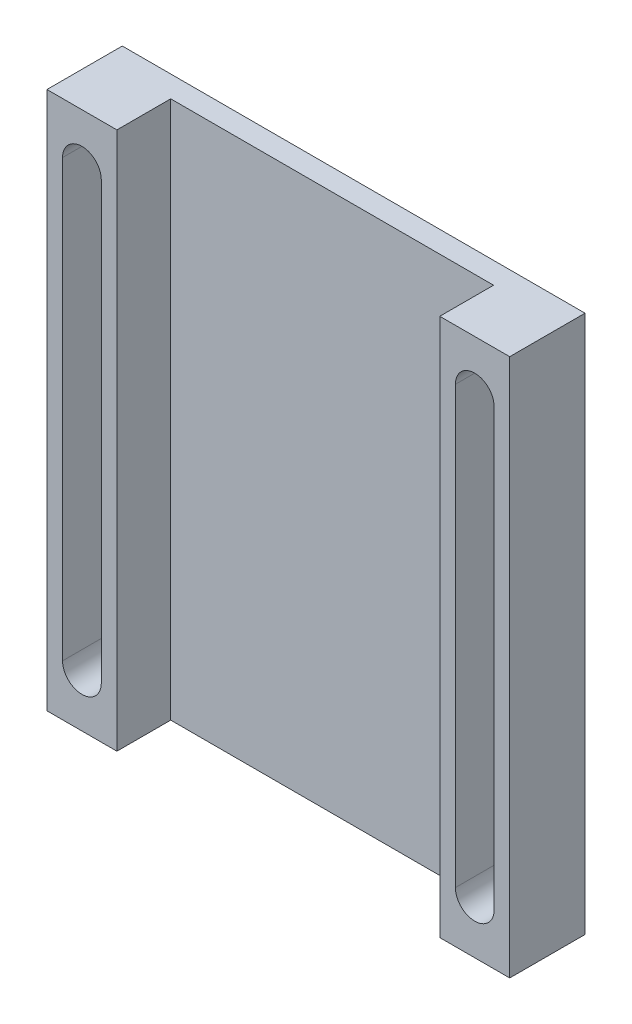
ISO-10303-21;
HEADER;
FILE_DESCRIPTION(('STEP AP214'),'2;1');
FILE_NAME('part.step','',(''),(''),'','','');
FILE_SCHEMA(('AUTOMOTIVE_DESIGN { 1 0 10303 214 1 1 1 1 }'));
ENDSEC;
DATA;
#1=APPLICATION_CONTEXT('core data for automotive mechanical design processes');
#2=APPLICATION_PROTOCOL_DEFINITION('international standard','automotive_design',2000,#1);
#3=PRODUCT_CONTEXT('',#1,'mechanical');
#4=PRODUCT('Part','Part','',(#3));
#5=PRODUCT_RELATED_PRODUCT_CATEGORY('part','',(#4));
#6=PRODUCT_DEFINITION_FORMATION('','',#4);
#7=PRODUCT_DEFINITION_CONTEXT('part definition',#1,'design');
#8=PRODUCT_DEFINITION('design','',#6,#7);
#9=PRODUCT_DEFINITION_SHAPE('','',#8);
#10=(LENGTH_UNIT() NAMED_UNIT(*) SI_UNIT(.MILLI.,.METRE.));
#11=(NAMED_UNIT(*) PLANE_ANGLE_UNIT() SI_UNIT($,.RADIAN.));
#12=(NAMED_UNIT(*) SI_UNIT($,.STERADIAN.) SOLID_ANGLE_UNIT());
#13=UNCERTAINTY_MEASURE_WITH_UNIT(LENGTH_MEASURE(1.E-05),#10,'distance_accuracy_value','');
#14=(GEOMETRIC_REPRESENTATION_CONTEXT(3) GLOBAL_UNCERTAINTY_ASSIGNED_CONTEXT((#13)) GLOBAL_UNIT_ASSIGNED_CONTEXT((#10,
#11,#12)) REPRESENTATION_CONTEXT('',''));
#15=CARTESIAN_POINT('',(0.,0.,0.));
#16=DIRECTION('',(0.,0.,1.));
#17=DIRECTION('',(1.,0.,0.));
#18=AXIS2_PLACEMENT_3D('',#15,#16,#17);
#19=CARTESIAN_POINT('',(0.,0.,70.));
#20=DIRECTION('',(0.,0.,1.));
#21=DIRECTION('',(1.,0.,0.));
#22=AXIS2_PLACEMENT_3D('',#19,#20,#21);
#23=PLANE('',#22);
#24=DIRECTION('',(1.,0.,0.));
#25=VECTOR('',#24,1.);
#26=CARTESIAN_POINT('',(0.,250.,70.));
#27=LINE('',#26,#25);
#28=CARTESIAN_POINT('',(150.,250.,70.));
#29=VERTEX_POINT('',#28);
#30=CARTESIAN_POINT('',(215.,250.,70.));
#31=VERTEX_POINT('',#30);
#32=EDGE_CURVE('E268',#29,#31,#27,.T.);
#33=ORIENTED_EDGE('',*,*,#32,.F.);
#34=DIRECTION('',(0.,-1.,0.));
#35=VECTOR('',#34,1.);
#36=CARTESIAN_POINT('',(150.,0.,70.));
#37=LINE('',#36,#35);
#38=CARTESIAN_POINT('',(150.,-250.,70.));
#39=VERTEX_POINT('',#38);
#40=EDGE_CURVE('E271',#29,#39,#37,.T.);
#41=ORIENTED_EDGE('',*,*,#40,.T.);
#42=DIRECTION('',(1.,0.,0.));
#43=VECTOR('',#42,1.);
#44=CARTESIAN_POINT('',(0.,-250.,70.));
#45=LINE('',#44,#43);
#46=CARTESIAN_POINT('',(215.,-250.,70.));
#47=VERTEX_POINT('',#46);
#48=EDGE_CURVE('E273',#39,#47,#45,.T.);
#49=ORIENTED_EDGE('',*,*,#48,.T.);
#50=DIRECTION('',(0.,-1.,0.));
#51=VECTOR('',#50,1.);
#52=CARTESIAN_POINT('',(215.,0.,70.));
#53=LINE('',#52,#51);
#54=EDGE_CURVE('E275',#31,#47,#53,.T.);
#55=ORIENTED_EDGE('',*,*,#54,.F.);
#56=EDGE_LOOP('',(#33,#41,#49,#55));
#57=FACE_BOUND('',#56,.T.);
#58=CARTESIAN_POINT('',(182.5,-202.5,70.));
#59=DIRECTION('',(0.,0.,1.));
#60=DIRECTION('',(1.,0.,0.));
#61=AXIS2_PLACEMENT_3D('',#58,#59,#60);
#62=CIRCLE('',#61,18.);
#63=CARTESIAN_POINT('',(164.5,-202.5,70.));
#64=VERTEX_POINT('',#63);
#65=CARTESIAN_POINT('',(200.5,-202.5,70.));
#66=VERTEX_POINT('',#65);
#67=EDGE_CURVE('E223',#64,#66,#62,.T.);
#68=ORIENTED_EDGE('',*,*,#67,.F.);
#69=DIRECTION('',(0.,1.,0.));
#70=VECTOR('',#69,1.);
#71=CARTESIAN_POINT('',(164.5,0.,70.));
#72=LINE('',#71,#70);
#73=CARTESIAN_POINT('',(164.5,202.5,70.));
#74=VERTEX_POINT('',#73);
#75=EDGE_CURVE('E78',#64,#74,#72,.T.);
#76=ORIENTED_EDGE('',*,*,#75,.T.);
#77=CARTESIAN_POINT('',(182.5,202.5,70.));
#78=DIRECTION('',(0.,0.,1.));
#79=DIRECTION('',(1.,0.,0.));
#80=AXIS2_PLACEMENT_3D('',#77,#78,#79);
#81=CIRCLE('',#80,18.);
#82=CARTESIAN_POINT('',(200.5,202.5,70.));
#83=VERTEX_POINT('',#82);
#84=EDGE_CURVE('E230',#83,#74,#81,.T.);
#85=ORIENTED_EDGE('',*,*,#84,.F.);
#86=DIRECTION('',(0.,1.,0.));
#87=VECTOR('',#86,1.);
#88=CARTESIAN_POINT('',(200.5,0.,70.));
#89=LINE('',#88,#87);
#90=EDGE_CURVE('E226',#66,#83,#89,.T.);
#91=ORIENTED_EDGE('',*,*,#90,.F.);
#92=EDGE_LOOP('',(#68,#76,#85,#91));
#93=FACE_BOUND('',#92,.T.);
#94=ADVANCED_FACE('F61',(#57,#93),#23,.T.);
#95=CARTESIAN_POINT('',(0.,250.,20.));
#96=DIRECTION('',(0.,1.,0.));
#97=DIRECTION('',(0.,0.,1.));
#98=AXIS2_PLACEMENT_3D('',#95,#96,#97);
#99=PLANE('',#98);
#100=DIRECTION('',(1.,0.,0.));
#101=VECTOR('',#100,1.);
#102=CARTESIAN_POINT('',(0.,250.,0.));
#103=LINE('',#102,#101);
#104=CARTESIAN_POINT('',(-215.,250.,0.));
#105=VERTEX_POINT('',#104);
#106=CARTESIAN_POINT('',(215.,250.,0.));
#107=VERTEX_POINT('',#106);
#108=EDGE_CURVE('E292',#105,#107,#103,.T.);
#109=ORIENTED_EDGE('',*,*,#108,.F.);
#110=DIRECTION('',(0.,0.,-1.));
#111=VECTOR('',#110,1.);
#112=CARTESIAN_POINT('',(-215.,250.,70.));
#113=LINE('',#112,#111);
#114=CARTESIAN_POINT('',(-215.,250.,70.));
#115=VERTEX_POINT('',#114);
#116=EDGE_CURVE('E210',#115,#105,#113,.T.);
#117=ORIENTED_EDGE('',*,*,#116,.F.);
#118=DIRECTION('',(1.,0.,0.));
#119=VECTOR('',#118,1.);
#120=CARTESIAN_POINT('',(0.,250.,70.));
#121=LINE('',#120,#119);
#122=CARTESIAN_POINT('',(-150.,250.,70.));
#123=VERTEX_POINT('',#122);
#124=EDGE_CURVE('E258',#115,#123,#121,.T.);
#125=ORIENTED_EDGE('',*,*,#124,.T.);
#126=DIRECTION('',(0.,0.,-1.));
#127=VECTOR('',#126,1.);
#128=CARTESIAN_POINT('',(-150.,250.,70.));
#129=LINE('',#128,#127);
#130=CARTESIAN_POINT('',(-150.,250.,20.));
#131=VERTEX_POINT('',#130);
#132=EDGE_CURVE('E250',#123,#131,#129,.T.);
#133=ORIENTED_EDGE('',*,*,#132,.T.);
#134=DIRECTION('',(1.,0.,0.));
#135=VECTOR('',#134,1.);
#136=CARTESIAN_POINT('',(0.,250.,20.));
#137=LINE('',#136,#135);
#138=CARTESIAN_POINT('',(150.,250.,20.));
#139=VERTEX_POINT('',#138);
#140=EDGE_CURVE('E293',#131,#139,#137,.T.);
#141=ORIENTED_EDGE('',*,*,#140,.T.);
#142=DIRECTION('',(0.,0.,-1.));
#143=VECTOR('',#142,1.);
#144=CARTESIAN_POINT('',(150.,250.,70.));
#145=LINE('',#144,#143);
#146=EDGE_CURVE('E289',#29,#139,#145,.T.);
#147=ORIENTED_EDGE('',*,*,#146,.F.);
#148=ORIENTED_EDGE('',*,*,#32,.T.);
#149=DIRECTION('',(0.,0.,-1.));
#150=VECTOR('',#149,1.);
#151=CARTESIAN_POINT('',(215.,250.,70.));
#152=LINE('',#151,#150);
#153=EDGE_CURVE('E278',#31,#107,#152,.T.);
#154=ORIENTED_EDGE('',*,*,#153,.T.);
#155=EDGE_LOOP('',(#109,#117,#125,#133,#141,#147,#148,#154));
#156=FACE_BOUND('',#155,.T.);
#157=ADVANCED_FACE('F63',(#156),#99,.T.);
#158=CARTESIAN_POINT('',(0.,-250.,20.));
#159=DIRECTION('',(0.,1.,0.));
#160=DIRECTION('',(0.,0.,1.));
#161=AXIS2_PLACEMENT_3D('',#158,#159,#160);
#162=PLANE('',#161);
#163=DIRECTION('',(1.,0.,0.));
#164=VECTOR('',#163,1.);
#165=CARTESIAN_POINT('',(0.,-250.,0.));
#166=LINE('',#165,#164);
#167=CARTESIAN_POINT('',(-215.,-250.,0.));
#168=VERTEX_POINT('',#167);
#169=CARTESIAN_POINT('',(215.,-250.,0.));
#170=VERTEX_POINT('',#169);
#171=EDGE_CURVE('E65',#168,#170,#166,.T.);
#172=ORIENTED_EDGE('',*,*,#171,.T.);
#173=DIRECTION('',(0.,0.,-1.));
#174=VECTOR('',#173,1.);
#175=CARTESIAN_POINT('',(215.,-250.,70.));
#176=LINE('',#175,#174);
#177=EDGE_CURVE('E283',#47,#170,#176,.T.);
#178=ORIENTED_EDGE('',*,*,#177,.F.);
#179=ORIENTED_EDGE('',*,*,#48,.F.);
#180=DIRECTION('',(0.,0.,-1.));
#181=VECTOR('',#180,1.);
#182=CARTESIAN_POINT('',(150.,-250.,70.));
#183=LINE('',#182,#181);
#184=CARTESIAN_POINT('',(150.,-250.,20.));
#185=VERTEX_POINT('',#184);
#186=EDGE_CURVE('E286',#39,#185,#183,.T.);
#187=ORIENTED_EDGE('',*,*,#186,.T.);
#188=DIRECTION('',(1.,0.,0.));
#189=VECTOR('',#188,1.);
#190=CARTESIAN_POINT('',(0.,-250.,20.));
#191=LINE('',#190,#189);
#192=CARTESIAN_POINT('',(-150.,-250.,20.));
#193=VERTEX_POINT('',#192);
#194=EDGE_CURVE('E70',#193,#185,#191,.T.);
#195=ORIENTED_EDGE('',*,*,#194,.F.);
#196=DIRECTION('',(0.,0.,-1.));
#197=VECTOR('',#196,1.);
#198=CARTESIAN_POINT('',(-150.,-250.,70.));
#199=LINE('',#198,#197);
#200=CARTESIAN_POINT('',(-150.,-250.,70.));
#201=VERTEX_POINT('',#200);
#202=EDGE_CURVE('E248',#201,#193,#199,.T.);
#203=ORIENTED_EDGE('',*,*,#202,.F.);
#204=DIRECTION('',(1.,0.,0.));
#205=VECTOR('',#204,1.);
#206=CARTESIAN_POINT('',(0.,-250.,70.));
#207=LINE('',#206,#205);
#208=CARTESIAN_POINT('',(-215.,-250.,70.));
#209=VERTEX_POINT('',#208);
#210=EDGE_CURVE('E261',#209,#201,#207,.T.);
#211=ORIENTED_EDGE('',*,*,#210,.F.);
#212=DIRECTION('',(0.,0.,-1.));
#213=VECTOR('',#212,1.);
#214=CARTESIAN_POINT('',(-215.,-250.,70.));
#215=LINE('',#214,#213);
#216=EDGE_CURVE('E245',#209,#168,#215,.T.);
#217=ORIENTED_EDGE('',*,*,#216,.T.);
#218=EDGE_LOOP('',(#172,#178,#179,#187,#195,#203,#211,#217));
#219=FACE_BOUND('',#218,.T.);
#220=ADVANCED_FACE('F302',(#219),#162,.F.);
#221=CARTESIAN_POINT('',(0.,0.,20.));
#222=DIRECTION('',(0.,0.,1.));
#223=DIRECTION('',(1.,0.,0.));
#224=AXIS2_PLACEMENT_3D('',#221,#222,#223);
#225=PLANE('',#224);
#226=ORIENTED_EDGE('',*,*,#140,.F.);
#227=DIRECTION('',(0.,-1.,0.));
#228=VECTOR('',#227,1.);
#229=CARTESIAN_POINT('',(-150.,0.,20.));
#230=LINE('',#229,#228);
#231=EDGE_CURVE('E295',#131,#193,#230,.T.);
#232=ORIENTED_EDGE('',*,*,#231,.T.);
#233=ORIENTED_EDGE('',*,*,#194,.T.);
#234=DIRECTION('',(0.,-1.,0.));
#235=VECTOR('',#234,1.);
#236=CARTESIAN_POINT('',(150.,0.,20.));
#237=LINE('',#236,#235);
#238=EDGE_CURVE('E12',#139,#185,#237,.T.);
#239=ORIENTED_EDGE('',*,*,#238,.F.);
#240=EDGE_LOOP('',(#226,#232,#233,#239));
#241=FACE_BOUND('',#240,.T.);
#242=ADVANCED_FACE('F312',(#241),#225,.T.);
#243=CARTESIAN_POINT('',(0.,0.,0.));
#244=DIRECTION('',(0.,0.,1.));
#245=DIRECTION('',(1.,0.,0.));
#246=AXIS2_PLACEMENT_3D('',#243,#244,#245);
#247=PLANE('',#246);
#248=ORIENTED_EDGE('',*,*,#108,.T.);
#249=DIRECTION('',(0.,-1.,0.));
#250=VECTOR('',#249,1.);
#251=CARTESIAN_POINT('',(215.,0.,0.));
#252=LINE('',#251,#250);
#253=EDGE_CURVE('E257',#107,#170,#252,.T.);
#254=ORIENTED_EDGE('',*,*,#253,.T.);
#255=ORIENTED_EDGE('',*,*,#171,.F.);
#256=DIRECTION('',(0.,-1.,0.));
#257=VECTOR('',#256,1.);
#258=CARTESIAN_POINT('',(-215.,0.,0.));
#259=LINE('',#258,#257);
#260=EDGE_CURVE('E254',#105,#168,#259,.T.);
#261=ORIENTED_EDGE('',*,*,#260,.F.);
#262=EDGE_LOOP('',(#248,#254,#255,#261));
#263=FACE_BOUND('',#262,.T.);
#264=ADVANCED_FACE('F309',(#263),#247,.F.);
#265=CARTESIAN_POINT('',(150.,0.,70.));
#266=DIRECTION('',(1.,0.,0.));
#267=DIRECTION('',(0.,0.,-1.));
#268=AXIS2_PLACEMENT_3D('',#265,#266,#267);
#269=PLANE('',#268);
#270=ORIENTED_EDGE('',*,*,#146,.T.);
#271=ORIENTED_EDGE('',*,*,#238,.T.);
#272=ORIENTED_EDGE('',*,*,#186,.F.);
#273=ORIENTED_EDGE('',*,*,#40,.F.);
#274=EDGE_LOOP('',(#270,#271,#272,#273));
#275=FACE_BOUND('',#274,.T.);
#276=ADVANCED_FACE('F311',(#275),#269,.F.);
#277=CARTESIAN_POINT('',(215.,0.,70.));
#278=DIRECTION('',(1.,0.,0.));
#279=DIRECTION('',(0.,0.,-1.));
#280=AXIS2_PLACEMENT_3D('',#277,#278,#279);
#281=PLANE('',#280);
#282=ORIENTED_EDGE('',*,*,#253,.F.);
#283=ORIENTED_EDGE('',*,*,#153,.F.);
#284=ORIENTED_EDGE('',*,*,#54,.T.);
#285=ORIENTED_EDGE('',*,*,#177,.T.);
#286=EDGE_LOOP('',(#282,#283,#284,#285));
#287=FACE_BOUND('',#286,.T.);
#288=ADVANCED_FACE('F307',(#287),#281,.T.);
#289=CARTESIAN_POINT('',(-150.,0.,70.));
#290=DIRECTION('',(1.,0.,0.));
#291=DIRECTION('',(0.,0.,-1.));
#292=AXIS2_PLACEMENT_3D('',#289,#290,#291);
#293=PLANE('',#292);
#294=ORIENTED_EDGE('',*,*,#231,.F.);
#295=ORIENTED_EDGE('',*,*,#132,.F.);
#296=DIRECTION('',(0.,-1.,0.));
#297=VECTOR('',#296,1.);
#298=CARTESIAN_POINT('',(-150.,0.,70.));
#299=LINE('',#298,#297);
#300=EDGE_CURVE('E253',#123,#201,#299,.T.);
#301=ORIENTED_EDGE('',*,*,#300,.T.);
#302=ORIENTED_EDGE('',*,*,#202,.T.);
#303=EDGE_LOOP('',(#294,#295,#301,#302));
#304=FACE_BOUND('',#303,.T.);
#305=ADVANCED_FACE('F336',(#304),#293,.T.);
#306=CARTESIAN_POINT('',(-215.,0.,70.));
#307=DIRECTION('',(1.,0.,0.));
#308=DIRECTION('',(0.,0.,-1.));
#309=AXIS2_PLACEMENT_3D('',#306,#307,#308);
#310=PLANE('',#309);
#311=ORIENTED_EDGE('',*,*,#260,.T.);
#312=ORIENTED_EDGE('',*,*,#216,.F.);
#313=DIRECTION('',(0.,-1.,0.));
#314=VECTOR('',#313,1.);
#315=CARTESIAN_POINT('',(-215.,0.,70.));
#316=LINE('',#315,#314);
#317=EDGE_CURVE('E263',#115,#209,#316,.T.);
#318=ORIENTED_EDGE('',*,*,#317,.F.);
#319=ORIENTED_EDGE('',*,*,#116,.T.);
#320=EDGE_LOOP('',(#311,#312,#318,#319));
#321=FACE_BOUND('',#320,.T.);
#322=ADVANCED_FACE('F340',(#321),#310,.F.);
#323=CARTESIAN_POINT('',(0.,0.,70.));
#324=DIRECTION('',(0.,0.,1.));
#325=DIRECTION('',(1.,0.,0.));
#326=AXIS2_PLACEMENT_3D('',#323,#324,#325);
#327=PLANE('',#326);
#328=CARTESIAN_POINT('',(-182.5,-202.5,70.));
#329=DIRECTION('',(0.,0.,1.));
#330=DIRECTION('',(1.,0.,0.));
#331=AXIS2_PLACEMENT_3D('',#328,#329,#330);
#332=CIRCLE('',#331,18.);
#333=CARTESIAN_POINT('',(-200.5,-202.5,70.));
#334=VERTEX_POINT('',#333);
#335=CARTESIAN_POINT('',(-164.5,-202.5,70.));
#336=VERTEX_POINT('',#335);
#337=EDGE_CURVE('E86',#334,#336,#332,.T.);
#338=ORIENTED_EDGE('',*,*,#337,.F.);
#339=DIRECTION('',(0.,1.,0.));
#340=VECTOR('',#339,1.);
#341=CARTESIAN_POINT('',(-200.5,0.,70.));
#342=LINE('',#341,#340);
#343=CARTESIAN_POINT('',(-200.5,202.5,70.));
#344=VERTEX_POINT('',#343);
#345=EDGE_CURVE('E195',#334,#344,#342,.T.);
#346=ORIENTED_EDGE('',*,*,#345,.T.);
#347=CARTESIAN_POINT('',(-182.5,202.5,70.));
#348=DIRECTION('',(0.,0.,1.));
#349=DIRECTION('',(1.,0.,0.));
#350=AXIS2_PLACEMENT_3D('',#347,#348,#349);
#351=CIRCLE('',#350,18.);
#352=CARTESIAN_POINT('',(-164.5,202.5,70.));
#353=VERTEX_POINT('',#352);
#354=EDGE_CURVE('E198',#353,#344,#351,.T.);
#355=ORIENTED_EDGE('',*,*,#354,.F.);
#356=DIRECTION('',(0.,1.,0.));
#357=VECTOR('',#356,1.);
#358=CARTESIAN_POINT('',(-164.5,0.,70.));
#359=LINE('',#358,#357);
#360=EDGE_CURVE('E204',#336,#353,#359,.T.);
#361=ORIENTED_EDGE('',*,*,#360,.F.);
#362=EDGE_LOOP('',(#338,#346,#355,#361));
#363=FACE_BOUND('',#362,.T.);
#364=ORIENTED_EDGE('',*,*,#124,.F.);
#365=ORIENTED_EDGE('',*,*,#317,.T.);
#366=ORIENTED_EDGE('',*,*,#210,.T.);
#367=ORIENTED_EDGE('',*,*,#300,.F.);
#368=EDGE_LOOP('',(#364,#365,#366,#367));
#369=FACE_BOUND('',#368,.T.);
#370=ADVANCED_FACE('F333',(#363,#369),#327,.T.);
#371=CARTESIAN_POINT('',(-182.5,-202.5,23.));
#372=DIRECTION('',(0.,0.,1.));
#373=DIRECTION('',(1.,0.,0.));
#374=AXIS2_PLACEMENT_3D('',#371,#372,#373);
#375=CYLINDRICAL_SURFACE('',#374,18.);
#376=ORIENTED_EDGE('',*,*,#337,.T.);
#377=DIRECTION('',(0.,0.,1.));
#378=VECTOR('',#377,1.);
#379=CARTESIAN_POINT('',(-164.5,-202.5,23.));
#380=LINE('',#379,#378);
#381=CARTESIAN_POINT('',(-164.5,-202.5,23.));
#382=VERTEX_POINT('',#381);
#383=EDGE_CURVE('E174',#382,#336,#380,.T.);
#384=ORIENTED_EDGE('',*,*,#383,.F.);
#385=CARTESIAN_POINT('',(-182.5,-202.5,23.));
#386=DIRECTION('',(0.,0.,1.));
#387=DIRECTION('',(1.,0.,0.));
#388=AXIS2_PLACEMENT_3D('',#385,#386,#387);
#389=CIRCLE('',#388,18.);
#390=CARTESIAN_POINT('',(-200.5,-202.5,23.));
#391=VERTEX_POINT('',#390);
#392=EDGE_CURVE('E178',#391,#382,#389,.T.);
#393=ORIENTED_EDGE('',*,*,#392,.F.);
#394=DIRECTION('',(0.,0.,1.));
#395=VECTOR('',#394,1.);
#396=CARTESIAN_POINT('',(-200.5,-202.5,23.));
#397=LINE('',#396,#395);
#398=EDGE_CURVE('E208',#391,#334,#397,.T.);
#399=ORIENTED_EDGE('',*,*,#398,.T.);
#400=EDGE_LOOP('',(#376,#384,#393,#399));
#401=FACE_BOUND('',#400,.T.);
#402=ADVANCED_FACE('F176',(#401),#375,.F.);
#403=CARTESIAN_POINT('',(-200.5,0.,23.));
#404=DIRECTION('',(1.,0.,0.));
#405=DIRECTION('',(0.,0.,-1.));
#406=AXIS2_PLACEMENT_3D('',#403,#404,#405);
#407=PLANE('',#406);
#408=ORIENTED_EDGE('',*,*,#345,.F.);
#409=ORIENTED_EDGE('',*,*,#398,.F.);
#410=DIRECTION('',(0.,1.,0.));
#411=VECTOR('',#410,1.);
#412=CARTESIAN_POINT('',(-200.5,0.,23.));
#413=LINE('',#412,#411);
#414=CARTESIAN_POINT('',(-200.5,202.5,23.));
#415=VERTEX_POINT('',#414);
#416=EDGE_CURVE('E183',#391,#415,#413,.T.);
#417=ORIENTED_EDGE('',*,*,#416,.T.);
#418=DIRECTION('',(0.,0.,1.));
#419=VECTOR('',#418,1.);
#420=CARTESIAN_POINT('',(-200.5,202.5,23.));
#421=LINE('',#420,#419);
#422=EDGE_CURVE('E211',#415,#344,#421,.T.);
#423=ORIENTED_EDGE('',*,*,#422,.T.);
#424=EDGE_LOOP('',(#408,#409,#417,#423));
#425=FACE_BOUND('',#424,.T.);
#426=ADVANCED_FACE('F369',(#425),#407,.T.);
#427=CARTESIAN_POINT('',(-182.5,202.5,23.));
#428=DIRECTION('',(0.,0.,1.));
#429=DIRECTION('',(1.,0.,0.));
#430=AXIS2_PLACEMENT_3D('',#427,#428,#429);
#431=CYLINDRICAL_SURFACE('',#430,18.);
#432=ORIENTED_EDGE('',*,*,#354,.T.);
#433=ORIENTED_EDGE('',*,*,#422,.F.);
#434=CARTESIAN_POINT('',(-182.5,202.5,23.));
#435=DIRECTION('',(0.,0.,1.));
#436=DIRECTION('',(1.,0.,0.));
#437=AXIS2_PLACEMENT_3D('',#434,#435,#436);
#438=CIRCLE('',#437,18.);
#439=CARTESIAN_POINT('',(-164.5,202.5,23.));
#440=VERTEX_POINT('',#439);
#441=EDGE_CURVE('E191',#440,#415,#438,.T.);
#442=ORIENTED_EDGE('',*,*,#441,.F.);
#443=DIRECTION('',(0.,0.,1.));
#444=VECTOR('',#443,1.);
#445=CARTESIAN_POINT('',(-164.5,202.5,23.));
#446=LINE('',#445,#444);
#447=EDGE_CURVE('E182',#440,#353,#446,.T.);
#448=ORIENTED_EDGE('',*,*,#447,.T.);
#449=EDGE_LOOP('',(#432,#433,#442,#448));
#450=FACE_BOUND('',#449,.T.);
#451=ADVANCED_FACE('F372',(#450),#431,.F.);
#452=CARTESIAN_POINT('',(-164.5,0.,23.));
#453=DIRECTION('',(1.,0.,0.));
#454=DIRECTION('',(0.,0.,-1.));
#455=AXIS2_PLACEMENT_3D('',#452,#453,#454);
#456=PLANE('',#455);
#457=ORIENTED_EDGE('',*,*,#360,.T.);
#458=ORIENTED_EDGE('',*,*,#447,.F.);
#459=DIRECTION('',(0.,1.,0.));
#460=VECTOR('',#459,1.);
#461=CARTESIAN_POINT('',(-164.5,0.,23.));
#462=LINE('',#461,#460);
#463=EDGE_CURVE('E186',#382,#440,#462,.T.);
#464=ORIENTED_EDGE('',*,*,#463,.F.);
#465=ORIENTED_EDGE('',*,*,#383,.T.);
#466=EDGE_LOOP('',(#457,#458,#464,#465));
#467=FACE_BOUND('',#466,.T.);
#468=ADVANCED_FACE('F187',(#467),#456,.F.);
#469=CARTESIAN_POINT('',(-182.5,-202.5,23.));
#470=DIRECTION('',(0.,0.,1.));
#471=DIRECTION('',(1.,0.,0.));
#472=AXIS2_PLACEMENT_3D('',#469,#470,#471);
#473=PLANE('',#472);
#474=ORIENTED_EDGE('',*,*,#392,.T.);
#475=ORIENTED_EDGE('',*,*,#463,.T.);
#476=ORIENTED_EDGE('',*,*,#441,.T.);
#477=ORIENTED_EDGE('',*,*,#416,.F.);
#478=EDGE_LOOP('',(#474,#475,#476,#477));
#479=FACE_BOUND('',#478,.T.);
#480=ADVANCED_FACE('F194',(#479),#473,.T.);
#481=CARTESIAN_POINT('',(164.5,0.,23.));
#482=DIRECTION('',(1.,0.,0.));
#483=DIRECTION('',(0.,0.,-1.));
#484=AXIS2_PLACEMENT_3D('',#481,#482,#483);
#485=PLANE('',#484);
#486=ORIENTED_EDGE('',*,*,#75,.F.);
#487=DIRECTION('',(0.,0.,1.));
#488=VECTOR('',#487,1.);
#489=CARTESIAN_POINT('',(164.5,-202.5,23.));
#490=LINE('',#489,#488);
#491=CARTESIAN_POINT('',(164.5,-202.5,23.));
#492=VERTEX_POINT('',#491);
#493=EDGE_CURVE('E220',#492,#64,#490,.T.);
#494=ORIENTED_EDGE('',*,*,#493,.F.);
#495=DIRECTION('',(0.,1.,0.));
#496=VECTOR('',#495,1.);
#497=CARTESIAN_POINT('',(164.5,0.,23.));
#498=LINE('',#497,#496);
#499=CARTESIAN_POINT('',(164.5,202.5,23.));
#500=VERTEX_POINT('',#499);
#501=EDGE_CURVE('E227',#492,#500,#498,.T.);
#502=ORIENTED_EDGE('',*,*,#501,.T.);
#503=DIRECTION('',(0.,0.,1.));
#504=VECTOR('',#503,1.);
#505=CARTESIAN_POINT('',(164.5,202.5,23.));
#506=LINE('',#505,#504);
#507=EDGE_CURVE('E214',#500,#74,#506,.T.);
#508=ORIENTED_EDGE('',*,*,#507,.T.);
#509=EDGE_LOOP('',(#486,#494,#502,#508));
#510=FACE_BOUND('',#509,.T.);
#511=ADVANCED_FACE('F363',(#510),#485,.T.);
#512=CARTESIAN_POINT('',(182.5,202.5,23.));
#513=DIRECTION('',(0.,0.,1.));
#514=DIRECTION('',(1.,0.,0.));
#515=AXIS2_PLACEMENT_3D('',#512,#513,#514);
#516=CYLINDRICAL_SURFACE('',#515,18.);
#517=ORIENTED_EDGE('',*,*,#84,.T.);
#518=ORIENTED_EDGE('',*,*,#507,.F.);
#519=CARTESIAN_POINT('',(182.5,202.5,23.));
#520=DIRECTION('',(0.,0.,1.));
#521=DIRECTION('',(1.,0.,0.));
#522=AXIS2_PLACEMENT_3D('',#519,#520,#521);
#523=CIRCLE('',#522,18.);
#524=CARTESIAN_POINT('',(200.5,202.5,23.));
#525=VERTEX_POINT('',#524);
#526=EDGE_CURVE('E239',#525,#500,#523,.T.);
#527=ORIENTED_EDGE('',*,*,#526,.F.);
#528=DIRECTION('',(0.,0.,1.));
#529=VECTOR('',#528,1.);
#530=CARTESIAN_POINT('',(200.5,202.5,23.));
#531=LINE('',#530,#529);
#532=EDGE_CURVE('E216',#525,#83,#531,.T.);
#533=ORIENTED_EDGE('',*,*,#532,.T.);
#534=EDGE_LOOP('',(#517,#518,#527,#533));
#535=FACE_BOUND('',#534,.T.);
#536=ADVANCED_FACE('F359',(#535),#516,.F.);
#537=CARTESIAN_POINT('',(200.5,0.,23.));
#538=DIRECTION('',(1.,0.,0.));
#539=DIRECTION('',(0.,0.,-1.));
#540=AXIS2_PLACEMENT_3D('',#537,#538,#539);
#541=PLANE('',#540);
#542=ORIENTED_EDGE('',*,*,#90,.T.);
#543=ORIENTED_EDGE('',*,*,#532,.F.);
#544=DIRECTION('',(0.,1.,0.));
#545=VECTOR('',#544,1.);
#546=CARTESIAN_POINT('',(200.5,0.,23.));
#547=LINE('',#546,#545);
#548=CARTESIAN_POINT('',(200.5,-202.5,23.));
#549=VERTEX_POINT('',#548);
#550=EDGE_CURVE('E236',#549,#525,#547,.T.);
#551=ORIENTED_EDGE('',*,*,#550,.F.);
#552=DIRECTION('',(0.,0.,1.));
#553=VECTOR('',#552,1.);
#554=CARTESIAN_POINT('',(200.5,-202.5,23.));
#555=LINE('',#554,#553);
#556=EDGE_CURVE('E218',#549,#66,#555,.T.);
#557=ORIENTED_EDGE('',*,*,#556,.T.);
#558=EDGE_LOOP('',(#542,#543,#551,#557));
#559=FACE_BOUND('',#558,.T.);
#560=ADVANCED_FACE('F355',(#559),#541,.F.);
#561=CARTESIAN_POINT('',(182.5,-202.5,23.));
#562=DIRECTION('',(0.,0.,1.));
#563=DIRECTION('',(1.,0.,0.));
#564=AXIS2_PLACEMENT_3D('',#561,#562,#563);
#565=CYLINDRICAL_SURFACE('',#564,18.);
#566=ORIENTED_EDGE('',*,*,#67,.T.);
#567=ORIENTED_EDGE('',*,*,#556,.F.);
#568=CARTESIAN_POINT('',(182.5,-202.5,23.));
#569=DIRECTION('',(0.,0.,1.));
#570=DIRECTION('',(1.,0.,0.));
#571=AXIS2_PLACEMENT_3D('',#568,#569,#570);
#572=CIRCLE('',#571,18.);
#573=EDGE_CURVE('E222',#492,#549,#572,.T.);
#574=ORIENTED_EDGE('',*,*,#573,.F.);
#575=ORIENTED_EDGE('',*,*,#493,.T.);
#576=EDGE_LOOP('',(#566,#567,#574,#575));
#577=FACE_BOUND('',#576,.T.);
#578=ADVANCED_FACE('F351',(#577),#565,.F.);
#579=CARTESIAN_POINT('',(182.5,202.5,23.));
#580=DIRECTION('',(0.,0.,1.));
#581=DIRECTION('',(1.,0.,0.));
#582=AXIS2_PLACEMENT_3D('',#579,#580,#581);
#583=PLANE('',#582);
#584=ORIENTED_EDGE('',*,*,#501,.F.);
#585=ORIENTED_EDGE('',*,*,#573,.T.);
#586=ORIENTED_EDGE('',*,*,#550,.T.);
#587=ORIENTED_EDGE('',*,*,#526,.T.);
#588=EDGE_LOOP('',(#584,#585,#586,#587));
#589=FACE_BOUND('',#588,.T.);
#590=ADVANCED_FACE('F348',(#589),#583,.T.);
#591=CLOSED_SHELL('',(#94,#157,#220,#242,#264,#276,#288,#305,#322,#370,#402,#426,#451,#468,#480,
#511,#536,#560,#578,#590));
#592=MANIFOLD_SOLID_BREP('B2',#591);
#593=ADVANCED_BREP_SHAPE_REPRESENTATION('',(#18,#592),#14);
#594=SHAPE_DEFINITION_REPRESENTATION(#9,#593);
ENDSEC;
END-ISO-10303-21;
